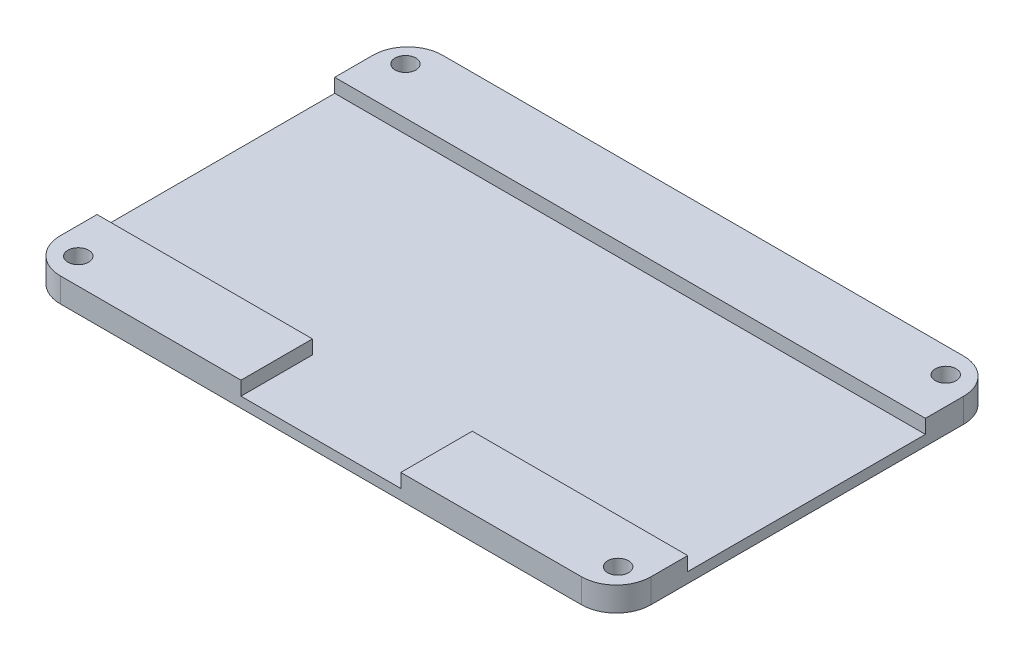
ISO-10303-21;
HEADER;
FILE_DESCRIPTION(('STEP AP214'),'2;1');
FILE_NAME('part.step','',(''),(''),'','','');
FILE_SCHEMA(('AUTOMOTIVE_DESIGN { 1 0 10303 214 1 1 1 1 }'));
ENDSEC;
DATA;
#1=APPLICATION_CONTEXT('core data for automotive mechanical design processes');
#2=APPLICATION_PROTOCOL_DEFINITION('international standard','automotive_design',2000,#1);
#3=PRODUCT_CONTEXT('',#1,'mechanical');
#4=PRODUCT('Part','Part','',(#3));
#5=PRODUCT_RELATED_PRODUCT_CATEGORY('part','',(#4));
#6=PRODUCT_DEFINITION_FORMATION('','',#4);
#7=PRODUCT_DEFINITION_CONTEXT('part definition',#1,'design');
#8=PRODUCT_DEFINITION('design','',#6,#7);
#9=PRODUCT_DEFINITION_SHAPE('','',#8);
#10=(LENGTH_UNIT() NAMED_UNIT(*) SI_UNIT(.MILLI.,.METRE.));
#11=(NAMED_UNIT(*) PLANE_ANGLE_UNIT() SI_UNIT($,.RADIAN.));
#12=(NAMED_UNIT(*) SI_UNIT($,.STERADIAN.) SOLID_ANGLE_UNIT());
#13=UNCERTAINTY_MEASURE_WITH_UNIT(LENGTH_MEASURE(1.E-05),#10,'distance_accuracy_value','');
#14=(GEOMETRIC_REPRESENTATION_CONTEXT(3) GLOBAL_UNCERTAINTY_ASSIGNED_CONTEXT((#13)) GLOBAL_UNIT_ASSIGNED_CONTEXT((#10,
#11,#12)) REPRESENTATION_CONTEXT('',''));
#15=CARTESIAN_POINT('',(0.,0.,0.));
#16=DIRECTION('',(0.,0.,1.));
#17=DIRECTION('',(1.,0.,0.));
#18=AXIS2_PLACEMENT_3D('',#15,#16,#17);
#19=CARTESIAN_POINT('',(59.3775100401606,3.5,-2.56526104417667));
#20=DIRECTION('',(-1.,0.,0.));
#21=DIRECTION('',(0.,0.,1.));
#22=AXIS2_PLACEMENT_3D('',#19,#20,#21);
#23=PLANE('',#22);
#24=DIRECTION('',(0.,1.,0.));
#25=VECTOR('',#24,1.);
#26=CARTESIAN_POINT('',(59.3775100401606,1.5,2.9472813848257));
#27=LINE('',#26,#25);
#28=CARTESIAN_POINT('',(59.3775100401606,1.5,2.9472813848257));
#29=VERTEX_POINT('',#28);
#30=CARTESIAN_POINT('',(59.3775100401606,3.5,2.9472813848257));
#31=VERTEX_POINT('',#30);
#32=EDGE_CURVE('E288',#29,#31,#27,.T.);
#33=ORIENTED_EDGE('',*,*,#32,.F.);
#34=DIRECTION('',(0.,0.,-1.));
#35=VECTOR('',#34,1.);
#36=CARTESIAN_POINT('',(59.3775100401606,1.5,0.));
#37=LINE('',#36,#35);
#38=CARTESIAN_POINT('',(59.3775100401606,1.5,37.1509688802206));
#39=VERTEX_POINT('',#38);
#40=EDGE_CURVE('E335',#39,#29,#37,.T.);
#41=ORIENTED_EDGE('',*,*,#40,.F.);
#42=DIRECTION('',(0.,1.,0.));
#43=VECTOR('',#42,1.);
#44=CARTESIAN_POINT('',(59.3775100401606,1.5,37.1509688802206));
#45=LINE('',#44,#43);
#46=CARTESIAN_POINT('',(59.3775100401606,3.5,37.1509688802206));
#47=VERTEX_POINT('',#46);
#48=EDGE_CURVE('E285',#39,#47,#45,.T.);
#49=ORIENTED_EDGE('',*,*,#48,.T.);
#50=DIRECTION('',(0.,0.,-1.));
#51=VECTOR('',#50,1.);
#52=CARTESIAN_POINT('',(59.3775100401606,3.5,-2.56526104417667));
#53=LINE('',#52,#51);
#54=CARTESIAN_POINT('',(59.3775100401606,3.5,42.4347389558233));
#55=VERTEX_POINT('',#54);
#56=EDGE_CURVE('E109',#55,#47,#53,.T.);
#57=ORIENTED_EDGE('',*,*,#56,.F.);
#58=DIRECTION('',(0.,-1.,0.));
#59=VECTOR('',#58,1.);
#60=CARTESIAN_POINT('',(59.3775100401606,3.5,42.4347389558233));
#61=LINE('',#60,#59);
#62=CARTESIAN_POINT('',(59.3775100401606,0.,42.4347389558233));
#63=VERTEX_POINT('',#62);
#64=EDGE_CURVE('E11',#55,#63,#61,.T.);
#65=ORIENTED_EDGE('',*,*,#64,.T.);
#66=DIRECTION('',(0.,0.,-1.));
#67=VECTOR('',#66,1.);
#68=CARTESIAN_POINT('',(59.3775100401606,0.,-2.56526104417667));
#69=LINE('',#68,#67);
#70=CARTESIAN_POINT('',(59.3775100401606,0.,-2.56526104417667));
#71=VERTEX_POINT('',#70);
#72=EDGE_CURVE('E175',#63,#71,#69,.T.);
#73=ORIENTED_EDGE('',*,*,#72,.T.);
#74=DIRECTION('',(0.,-1.,0.));
#75=VECTOR('',#74,1.);
#76=CARTESIAN_POINT('',(59.3775100401606,3.5,-2.56526104417667));
#77=LINE('',#76,#75);
#78=CARTESIAN_POINT('',(59.3775100401606,3.5,-2.56526104417667));
#79=VERTEX_POINT('',#78);
#80=EDGE_CURVE('E52',#79,#71,#77,.T.);
#81=ORIENTED_EDGE('',*,*,#80,.F.);
#82=EDGE_CURVE('E243',#31,#79,#53,.T.);
#83=ORIENTED_EDGE('',*,*,#82,.F.);
#84=EDGE_LOOP('',(#33,#41,#49,#57,#65,#73,#81,#83));
#85=FACE_BOUND('',#84,.T.);
#86=ADVANCED_FACE('F43',(#85),#23,.F.);
#87=CARTESIAN_POINT('',(54.3775100401606,3.5,42.4347389558233));
#88=DIRECTION('',(0.,1.,0.));
#89=DIRECTION('',(0.,0.,1.));
#90=AXIS2_PLACEMENT_3D('',#87,#88,#89);
#91=PLANE('',#90);
#92=CARTESIAN_POINT('',(-22.1875669871682,3.5,-3.8027186151743));
#93=DIRECTION('',(0.,1.,0.));
#94=DIRECTION('',(0.,0.,1.));
#95=AXIS2_PLACEMENT_3D('',#92,#93,#94);
#96=CIRCLE('',#95,1.5);
#97=CARTESIAN_POINT('',(-22.1875669871682,3.5,-2.3027186151743));
#98=VERTEX_POINT('',#97);
#99=EDGE_CURVE('E258',#98,#98,#96,.T.);
#100=ORIENTED_EDGE('',*,*,#99,.F.);
#101=EDGE_LOOP('',(#100));
#102=FACE_BOUND('',#101,.T.);
#103=CARTESIAN_POINT('',(55.4124330128318,3.5,-3.94786533941863));
#104=DIRECTION('',(0.,1.,0.));
#105=DIRECTION('',(0.,0.,1.));
#106=AXIS2_PLACEMENT_3D('',#103,#104,#105);
#107=CIRCLE('',#106,1.5);
#108=CARTESIAN_POINT('',(55.4124330128318,3.5,-2.44786533941862));
#109=VERTEX_POINT('',#108);
#110=EDGE_CURVE('E267',#109,#109,#107,.T.);
#111=ORIENTED_EDGE('',*,*,#110,.F.);
#112=EDGE_LOOP('',(#111));
#113=FACE_BOUND('',#112,.T.);
#114=DIRECTION('',(0.,0.,1.));
#115=VECTOR('',#114,1.);
#116=CARTESIAN_POINT('',(-25.6224899598394,3.5,-2.56526104417667));
#117=LINE('',#116,#115);
#118=CARTESIAN_POINT('',(-25.6224899598394,3.5,-2.56526104417667));
#119=VERTEX_POINT('',#118);
#120=CARTESIAN_POINT('',(-25.6224899598394,3.5,2.9472813848257));
#121=VERTEX_POINT('',#120);
#122=EDGE_CURVE('E143',#119,#121,#117,.T.);
#123=ORIENTED_EDGE('',*,*,#122,.T.);
#124=DIRECTION('',(1.,0.,0.));
#125=VECTOR('',#124,1.);
#126=CARTESIAN_POINT('',(0.,3.5,2.9472813848257));
#127=LINE('',#126,#125);
#128=EDGE_CURVE('E312',#121,#31,#127,.T.);
#129=ORIENTED_EDGE('',*,*,#128,.T.);
#130=ORIENTED_EDGE('',*,*,#82,.T.);
#131=CARTESIAN_POINT('',(54.3775100401606,3.5,-2.56526104417671));
#132=DIRECTION('',(0.,1.,0.));
#133=DIRECTION('',(0.,0.,1.));
#134=AXIS2_PLACEMENT_3D('',#131,#132,#133);
#135=CIRCLE('',#134,5.);
#136=CARTESIAN_POINT('',(54.3775100401606,3.5,-7.56526104417671));
#137=VERTEX_POINT('',#136);
#138=EDGE_CURVE('E217',#79,#137,#135,.T.);
#139=ORIENTED_EDGE('',*,*,#138,.T.);
#140=DIRECTION('',(-1.,0.,0.));
#141=VECTOR('',#140,1.);
#142=CARTESIAN_POINT('',(-20.6224899598393,3.5,-7.56526104417671));
#143=LINE('',#142,#141);
#144=CARTESIAN_POINT('',(-20.6224899598394,3.5,-7.56526104417671));
#145=VERTEX_POINT('',#144);
#146=EDGE_CURVE('E235',#137,#145,#143,.T.);
#147=ORIENTED_EDGE('',*,*,#146,.T.);
#148=CARTESIAN_POINT('',(-20.6224899598394,3.5,-2.56526104417671));
#149=DIRECTION('',(0.,1.,0.));
#150=DIRECTION('',(0.,0.,-1.));
#151=AXIS2_PLACEMENT_3D('',#148,#149,#150);
#152=CIRCLE('',#151,5.);
#153=EDGE_CURVE('E144',#145,#119,#152,.T.);
#154=ORIENTED_EDGE('',*,*,#153,.T.);
#155=EDGE_LOOP('',(#123,#129,#130,#139,#147,#154));
#156=FACE_BOUND('',#155,.T.);
#157=ADVANCED_FACE('F404',(#102,#113,#156),#91,.T.);
#158=DIRECTION('',(0.,0.,1.));
#159=VECTOR('',#158,1.);
#160=CARTESIAN_POINT('',(5.37751004016062,3.5,0.));
#161=LINE('',#160,#159);
#162=CARTESIAN_POINT('',(5.37751004016063,3.5,37.1509688802206));
#163=VERTEX_POINT('',#162);
#164=CARTESIAN_POINT('',(5.37751004016063,3.5,47.4347389558233));
#165=VERTEX_POINT('',#164);
#166=EDGE_CURVE('E307',#163,#165,#161,.T.);
#167=ORIENTED_EDGE('',*,*,#166,.F.);
#168=DIRECTION('',(1.,0.,0.));
#169=VECTOR('',#168,1.);
#170=CARTESIAN_POINT('',(0.,3.5,37.1509688802206));
#171=LINE('',#170,#169);
#172=CARTESIAN_POINT('',(-25.6224899598394,3.5,37.1509688802206));
#173=VERTEX_POINT('',#172);
#174=EDGE_CURVE('E139',#173,#163,#171,.T.);
#175=ORIENTED_EDGE('',*,*,#174,.F.);
#176=CARTESIAN_POINT('',(-25.6224899598394,3.5,42.4347389558233));
#177=VERTEX_POINT('',#176);
#178=EDGE_CURVE('E128',#173,#177,#117,.T.);
#179=ORIENTED_EDGE('',*,*,#178,.T.);
#180=CARTESIAN_POINT('',(-20.6224899598394,3.5,42.4347389558233));
#181=DIRECTION('',(0.,1.,0.));
#182=DIRECTION('',(0.,0.,-1.));
#183=AXIS2_PLACEMENT_3D('',#180,#181,#182);
#184=CIRCLE('',#183,5.);
#185=CARTESIAN_POINT('',(-20.6224899598393,3.5,47.4347389558233));
#186=VERTEX_POINT('',#185);
#187=EDGE_CURVE('E135',#177,#186,#184,.T.);
#188=ORIENTED_EDGE('',*,*,#187,.T.);
#189=DIRECTION('',(1.,0.,0.));
#190=VECTOR('',#189,1.);
#191=CARTESIAN_POINT('',(-20.6224899598393,3.5,47.4347389558233));
#192=LINE('',#191,#190);
#193=EDGE_CURVE('E164',#186,#165,#192,.T.);
#194=ORIENTED_EDGE('',*,*,#193,.T.);
#195=EDGE_LOOP('',(#167,#175,#179,#188,#194));
#196=FACE_BOUND('',#195,.T.);
#197=CARTESIAN_POINT('',(-21.7754371988893,3.5,43.6972813848257));
#198=DIRECTION('',(0.,1.,0.));
#199=DIRECTION('',(0.,0.,1.));
#200=AXIS2_PLACEMENT_3D('',#197,#198,#199);
#201=CIRCLE('',#200,1.5);
#202=CARTESIAN_POINT('',(-21.7754371988893,3.5,45.1972813848257));
#203=VERTEX_POINT('',#202);
#204=EDGE_CURVE('E246',#203,#203,#201,.T.);
#205=ORIENTED_EDGE('',*,*,#204,.F.);
#206=EDGE_LOOP('',(#205));
#207=FACE_BOUND('',#206,.T.);
#208=ADVANCED_FACE('F131',(#196,#207),#91,.T.);
#209=CARTESIAN_POINT('',(54.3775100401606,3.5,42.4347389558233));
#210=DIRECTION('',(0.,-1.,0.));
#211=DIRECTION('',(0.,0.,-1.));
#212=AXIS2_PLACEMENT_3D('',#209,#210,#211);
#213=CYLINDRICAL_SURFACE('',#212,5.);
#214=CARTESIAN_POINT('',(54.3775100401606,0.,42.4347389558233));
#215=DIRECTION('',(0.,1.,0.));
#216=DIRECTION('',(0.,0.,1.));
#217=AXIS2_PLACEMENT_3D('',#214,#215,#216);
#218=CIRCLE('',#217,5.);
#219=CARTESIAN_POINT('',(54.3775100401606,0.,47.4347389558233));
#220=VERTEX_POINT('',#219);
#221=EDGE_CURVE('E171',#220,#63,#218,.T.);
#222=ORIENTED_EDGE('',*,*,#221,.T.);
#223=ORIENTED_EDGE('',*,*,#64,.F.);
#224=CARTESIAN_POINT('',(54.3775100401606,3.5,42.4347389558233));
#225=DIRECTION('',(0.,1.,0.));
#226=DIRECTION('',(0.,0.,1.));
#227=AXIS2_PLACEMENT_3D('',#224,#225,#226);
#228=CIRCLE('',#227,5.);
#229=CARTESIAN_POINT('',(54.3775100401606,3.5,47.4347389558233));
#230=VERTEX_POINT('',#229);
#231=EDGE_CURVE('E195',#230,#55,#228,.T.);
#232=ORIENTED_EDGE('',*,*,#231,.F.);
#233=DIRECTION('',(0.,-1.,0.));
#234=VECTOR('',#233,1.);
#235=CARTESIAN_POINT('',(54.3775100401606,3.5,47.4347389558233));
#236=LINE('',#235,#234);
#237=EDGE_CURVE('E170',#230,#220,#236,.T.);
#238=ORIENTED_EDGE('',*,*,#237,.T.);
#239=EDGE_LOOP('',(#222,#223,#232,#238));
#240=FACE_BOUND('',#239,.T.);
#241=ADVANCED_FACE('F45',(#240),#213,.T.);
#242=CARTESIAN_POINT('',(54.3775100401606,3.5,-2.56526104417671));
#243=DIRECTION('',(0.,-1.,0.));
#244=DIRECTION('',(0.,0.,-1.));
#245=AXIS2_PLACEMENT_3D('',#242,#243,#244);
#246=CYLINDRICAL_SURFACE('',#245,5.);
#247=CARTESIAN_POINT('',(54.3775100401606,0.,-2.56526104417671));
#248=DIRECTION('',(0.,1.,0.));
#249=DIRECTION('',(0.,0.,1.));
#250=AXIS2_PLACEMENT_3D('',#247,#248,#249);
#251=CIRCLE('',#250,5.);
#252=CARTESIAN_POINT('',(54.3775100401606,0.,-7.56526104417671));
#253=VERTEX_POINT('',#252);
#254=EDGE_CURVE('E179',#71,#253,#251,.T.);
#255=ORIENTED_EDGE('',*,*,#254,.T.);
#256=DIRECTION('',(0.,-1.,0.));
#257=VECTOR('',#256,1.);
#258=CARTESIAN_POINT('',(54.3775100401606,3.5,-7.56526104417671));
#259=LINE('',#258,#257);
#260=EDGE_CURVE('E206',#137,#253,#259,.T.);
#261=ORIENTED_EDGE('',*,*,#260,.F.);
#262=ORIENTED_EDGE('',*,*,#138,.F.);
#263=ORIENTED_EDGE('',*,*,#80,.T.);
#264=EDGE_LOOP('',(#255,#261,#262,#263));
#265=FACE_BOUND('',#264,.T.);
#266=ADVANCED_FACE('F215',(#265),#246,.T.);
#267=CARTESIAN_POINT('',(-20.6224899598393,3.5,-7.56526104417671));
#268=DIRECTION('',(0.,0.,1.));
#269=DIRECTION('',(1.,0.,0.));
#270=AXIS2_PLACEMENT_3D('',#267,#268,#269);
#271=PLANE('',#270);
#272=DIRECTION('',(-1.,0.,0.));
#273=VECTOR('',#272,1.);
#274=CARTESIAN_POINT('',(-20.6224899598393,0.,-7.56526104417671));
#275=LINE('',#274,#273);
#276=CARTESIAN_POINT('',(-20.6224899598394,0.,-7.56526104417671));
#277=VERTEX_POINT('',#276);
#278=EDGE_CURVE('E182',#253,#277,#275,.T.);
#279=ORIENTED_EDGE('',*,*,#278,.T.);
#280=DIRECTION('',(0.,-1.,0.));
#281=VECTOR('',#280,1.);
#282=CARTESIAN_POINT('',(-20.6224899598394,3.5,-7.56526104417671));
#283=LINE('',#282,#281);
#284=EDGE_CURVE('E202',#145,#277,#283,.T.);
#285=ORIENTED_EDGE('',*,*,#284,.F.);
#286=ORIENTED_EDGE('',*,*,#146,.F.);
#287=ORIENTED_EDGE('',*,*,#260,.T.);
#288=EDGE_LOOP('',(#279,#285,#286,#287));
#289=FACE_BOUND('',#288,.T.);
#290=ADVANCED_FACE('F226',(#289),#271,.F.);
#291=CARTESIAN_POINT('',(-20.6224899598394,3.5,-2.56526104417671));
#292=DIRECTION('',(0.,-1.,0.));
#293=DIRECTION('',(0.,0.,-1.));
#294=AXIS2_PLACEMENT_3D('',#291,#292,#293);
#295=CYLINDRICAL_SURFACE('',#294,5.);
#296=CARTESIAN_POINT('',(-20.6224899598394,0.,-2.56526104417671));
#297=DIRECTION('',(0.,1.,0.));
#298=DIRECTION('',(0.,0.,-1.));
#299=AXIS2_PLACEMENT_3D('',#296,#297,#298);
#300=CIRCLE('',#299,5.);
#301=CARTESIAN_POINT('',(-25.6224899598394,0.,-2.56526104417667));
#302=VERTEX_POINT('',#301);
#303=EDGE_CURVE('E185',#277,#302,#300,.T.);
#304=ORIENTED_EDGE('',*,*,#303,.T.);
#305=DIRECTION('',(0.,-1.,0.));
#306=VECTOR('',#305,1.);
#307=CARTESIAN_POINT('',(-25.6224899598394,3.5,-2.56526104417667));
#308=LINE('',#307,#306);
#309=EDGE_CURVE('E155',#119,#302,#308,.T.);
#310=ORIENTED_EDGE('',*,*,#309,.F.);
#311=ORIENTED_EDGE('',*,*,#153,.F.);
#312=ORIENTED_EDGE('',*,*,#284,.T.);
#313=EDGE_LOOP('',(#304,#310,#311,#312));
#314=FACE_BOUND('',#313,.T.);
#315=ADVANCED_FACE('F230',(#314),#295,.T.);
#316=CARTESIAN_POINT('',(-25.6224899598394,3.5,-2.56526104417667));
#317=DIRECTION('',(1.,0.,0.));
#318=DIRECTION('',(0.,0.,-1.));
#319=AXIS2_PLACEMENT_3D('',#316,#317,#318);
#320=PLANE('',#319);
#321=ORIENTED_EDGE('',*,*,#178,.F.);
#322=DIRECTION('',(0.,1.,0.));
#323=VECTOR('',#322,1.);
#324=CARTESIAN_POINT('',(-25.6224899598394,1.5,37.1509688802206));
#325=LINE('',#324,#323);
#326=CARTESIAN_POINT('',(-25.6224899598394,1.5,37.1509688802206));
#327=VERTEX_POINT('',#326);
#328=EDGE_CURVE('E296',#327,#173,#325,.T.);
#329=ORIENTED_EDGE('',*,*,#328,.F.);
#330=DIRECTION('',(0.,0.,1.));
#331=VECTOR('',#330,1.);
#332=CARTESIAN_POINT('',(-25.6224899598394,1.5,0.));
#333=LINE('',#332,#331);
#334=CARTESIAN_POINT('',(-25.6224899598394,1.5,2.9472813848257));
#335=VERTEX_POINT('',#334);
#336=EDGE_CURVE('E327',#335,#327,#333,.T.);
#337=ORIENTED_EDGE('',*,*,#336,.F.);
#338=DIRECTION('',(0.,1.,0.));
#339=VECTOR('',#338,1.);
#340=CARTESIAN_POINT('',(-25.6224899598394,1.5,2.9472813848257));
#341=LINE('',#340,#339);
#342=EDGE_CURVE('E292',#335,#121,#341,.T.);
#343=ORIENTED_EDGE('',*,*,#342,.T.);
#344=ORIENTED_EDGE('',*,*,#122,.F.);
#345=ORIENTED_EDGE('',*,*,#309,.T.);
#346=DIRECTION('',(0.,0.,1.));
#347=VECTOR('',#346,1.);
#348=CARTESIAN_POINT('',(-25.6224899598394,0.,-2.56526104417667));
#349=LINE('',#348,#347);
#350=CARTESIAN_POINT('',(-25.6224899598394,0.,42.4347389558233));
#351=VERTEX_POINT('',#350);
#352=EDGE_CURVE('E151',#302,#351,#349,.T.);
#353=ORIENTED_EDGE('',*,*,#352,.T.);
#354=DIRECTION('',(0.,-1.,0.));
#355=VECTOR('',#354,1.);
#356=CARTESIAN_POINT('',(-25.6224899598394,3.5,42.4347389558233));
#357=LINE('',#356,#355);
#358=EDGE_CURVE('E147',#177,#351,#357,.T.);
#359=ORIENTED_EDGE('',*,*,#358,.F.);
#360=EDGE_LOOP('',(#321,#329,#337,#343,#344,#345,#353,#359));
#361=FACE_BOUND('',#360,.T.);
#362=ADVANCED_FACE('F148',(#361),#320,.F.);
#363=CARTESIAN_POINT('',(-20.6224899598394,3.5,42.4347389558233));
#364=DIRECTION('',(0.,-1.,0.));
#365=DIRECTION('',(0.,0.,-1.));
#366=AXIS2_PLACEMENT_3D('',#363,#364,#365);
#367=CYLINDRICAL_SURFACE('',#366,5.);
#368=CARTESIAN_POINT('',(-20.6224899598394,0.,42.4347389558233));
#369=DIRECTION('',(0.,1.,0.));
#370=DIRECTION('',(0.,0.,-1.));
#371=AXIS2_PLACEMENT_3D('',#368,#369,#370);
#372=CIRCLE('',#371,5.);
#373=CARTESIAN_POINT('',(-20.6224899598393,0.,47.4347389558233));
#374=VERTEX_POINT('',#373);
#375=EDGE_CURVE('E190',#351,#374,#372,.T.);
#376=ORIENTED_EDGE('',*,*,#375,.T.);
#377=DIRECTION('',(0.,-1.,0.));
#378=VECTOR('',#377,1.);
#379=CARTESIAN_POINT('',(-20.6224899598393,3.5,47.4347389558233));
#380=LINE('',#379,#378);
#381=EDGE_CURVE('E156',#186,#374,#380,.T.);
#382=ORIENTED_EDGE('',*,*,#381,.F.);
#383=ORIENTED_EDGE('',*,*,#187,.F.);
#384=ORIENTED_EDGE('',*,*,#358,.T.);
#385=EDGE_LOOP('',(#376,#382,#383,#384));
#386=FACE_BOUND('',#385,.T.);
#387=ADVANCED_FACE('F158',(#386),#367,.T.);
#388=CARTESIAN_POINT('',(-20.6224899598393,3.5,47.4347389558233));
#389=DIRECTION('',(0.,0.,-1.));
#390=DIRECTION('',(-1.,0.,0.));
#391=AXIS2_PLACEMENT_3D('',#388,#389,#390);
#392=PLANE('',#391);
#393=DIRECTION('',(1.,0.,0.));
#394=VECTOR('',#393,1.);
#395=CARTESIAN_POINT('',(0.,1.5,47.4347389558233));
#396=LINE('',#395,#394);
#397=CARTESIAN_POINT('',(5.37751004016063,1.5,47.4347389558233));
#398=VERTEX_POINT('',#397);
#399=CARTESIAN_POINT('',(28.3775100401606,1.5,47.4347389558233));
#400=VERTEX_POINT('',#399);
#401=EDGE_CURVE('E311',#398,#400,#396,.T.);
#402=ORIENTED_EDGE('',*,*,#401,.F.);
#403=DIRECTION('',(0.,1.,0.));
#404=VECTOR('',#403,1.);
#405=CARTESIAN_POINT('',(5.37751004016063,1.5,47.4347389558233));
#406=LINE('',#405,#404);
#407=EDGE_CURVE('E259',#398,#165,#406,.T.);
#408=ORIENTED_EDGE('',*,*,#407,.T.);
#409=ORIENTED_EDGE('',*,*,#193,.F.);
#410=ORIENTED_EDGE('',*,*,#381,.T.);
#411=DIRECTION('',(1.,0.,0.));
#412=VECTOR('',#411,1.);
#413=CARTESIAN_POINT('',(-20.6224899598393,0.,47.4347389558233));
#414=LINE('',#413,#412);
#415=EDGE_CURVE('E101',#374,#220,#414,.T.);
#416=ORIENTED_EDGE('',*,*,#415,.T.);
#417=ORIENTED_EDGE('',*,*,#237,.F.);
#418=CARTESIAN_POINT('',(28.3775100401606,3.5,47.4347389558233));
#419=VERTEX_POINT('',#418);
#420=EDGE_CURVE('E67',#419,#230,#192,.T.);
#421=ORIENTED_EDGE('',*,*,#420,.F.);
#422=DIRECTION('',(0.,1.,0.));
#423=VECTOR('',#422,1.);
#424=CARTESIAN_POINT('',(28.3775100401606,1.5,47.4347389558233));
#425=LINE('',#424,#423);
#426=EDGE_CURVE('E59',#400,#419,#425,.T.);
#427=ORIENTED_EDGE('',*,*,#426,.F.);
#428=EDGE_LOOP('',(#402,#408,#409,#410,#416,#417,#421,#427));
#429=FACE_BOUND('',#428,.T.);
#430=ADVANCED_FACE('F357',(#429),#392,.F.);
#431=CARTESIAN_POINT('',(28.3775100401606,3.5,37.1509688802206));
#432=VERTEX_POINT('',#431);
#433=EDGE_CURVE('E316',#432,#47,#171,.T.);
#434=ORIENTED_EDGE('',*,*,#433,.F.);
#435=DIRECTION('',(0.,0.,-1.));
#436=VECTOR('',#435,1.);
#437=CARTESIAN_POINT('',(28.3775100401606,3.5,0.));
#438=LINE('',#437,#436);
#439=EDGE_CURVE('E320',#419,#432,#438,.T.);
#440=ORIENTED_EDGE('',*,*,#439,.F.);
#441=ORIENTED_EDGE('',*,*,#420,.T.);
#442=ORIENTED_EDGE('',*,*,#231,.T.);
#443=ORIENTED_EDGE('',*,*,#56,.T.);
#444=EDGE_LOOP('',(#434,#440,#441,#442,#443));
#445=FACE_BOUND('',#444,.T.);
#446=CARTESIAN_POINT('',(55.7665058119681,3.5,43.5521346605813));
#447=DIRECTION('',(0.,1.,0.));
#448=DIRECTION('',(0.,0.,1.));
#449=AXIS2_PLACEMENT_3D('',#446,#447,#448);
#450=CIRCLE('',#449,1.5);
#451=CARTESIAN_POINT('',(55.7665058119681,3.5,45.0521346605813));
#452=VERTEX_POINT('',#451);
#453=EDGE_CURVE('E250',#452,#452,#450,.T.);
#454=ORIENTED_EDGE('',*,*,#453,.F.);
#455=EDGE_LOOP('',(#454));
#456=FACE_BOUND('',#455,.T.);
#457=ADVANCED_FACE('F362',(#445,#456),#91,.T.);
#458=CARTESIAN_POINT('',(54.3775100401606,0.,42.4347389558233));
#459=DIRECTION('',(0.,1.,0.));
#460=DIRECTION('',(0.,0.,1.));
#461=AXIS2_PLACEMENT_3D('',#458,#459,#460);
#462=PLANE('',#461);
#463=CARTESIAN_POINT('',(-22.1875669871682,0.,-3.8027186151743));
#464=DIRECTION('',(0.,1.,0.));
#465=DIRECTION('',(0.,0.,1.));
#466=AXIS2_PLACEMENT_3D('',#463,#464,#465);
#467=CIRCLE('',#466,1.5);
#468=CARTESIAN_POINT('',(-22.1875669871682,0.,-2.3027186151743));
#469=VERTEX_POINT('',#468);
#470=EDGE_CURVE('E254',#469,#469,#467,.T.);
#471=ORIENTED_EDGE('',*,*,#470,.T.);
#472=EDGE_LOOP('',(#471));
#473=FACE_BOUND('',#472,.T.);
#474=CARTESIAN_POINT('',(55.4124330128318,0.,-3.94786533941863));
#475=DIRECTION('',(0.,1.,0.));
#476=DIRECTION('',(0.,0.,1.));
#477=AXIS2_PLACEMENT_3D('',#474,#475,#476);
#478=CIRCLE('',#477,1.5);
#479=CARTESIAN_POINT('',(55.4124330128318,0.,-2.44786533941862));
#480=VERTEX_POINT('',#479);
#481=EDGE_CURVE('E263',#480,#480,#478,.T.);
#482=ORIENTED_EDGE('',*,*,#481,.T.);
#483=EDGE_LOOP('',(#482));
#484=FACE_BOUND('',#483,.T.);
#485=CARTESIAN_POINT('',(55.7665058119681,0.,43.5521346605813));
#486=DIRECTION('',(0.,1.,0.));
#487=DIRECTION('',(0.,0.,1.));
#488=AXIS2_PLACEMENT_3D('',#485,#486,#487);
#489=CIRCLE('',#488,1.5);
#490=CARTESIAN_POINT('',(55.7665058119681,0.,45.0521346605813));
#491=VERTEX_POINT('',#490);
#492=EDGE_CURVE('E271',#491,#491,#489,.T.);
#493=ORIENTED_EDGE('',*,*,#492,.T.);
#494=EDGE_LOOP('',(#493));
#495=FACE_BOUND('',#494,.T.);
#496=CARTESIAN_POINT('',(-21.7754371988893,0.,43.6972813848257));
#497=DIRECTION('',(0.,1.,0.));
#498=DIRECTION('',(0.,0.,1.));
#499=AXIS2_PLACEMENT_3D('',#496,#497,#498);
#500=CIRCLE('',#499,1.5);
#501=CARTESIAN_POINT('',(-21.7754371988893,0.,45.1972813848257));
#502=VERTEX_POINT('',#501);
#503=EDGE_CURVE('E176',#502,#502,#500,.T.);
#504=ORIENTED_EDGE('',*,*,#503,.T.);
#505=EDGE_LOOP('',(#504));
#506=FACE_BOUND('',#505,.T.);
#507=ORIENTED_EDGE('',*,*,#221,.F.);
#508=ORIENTED_EDGE('',*,*,#415,.F.);
#509=ORIENTED_EDGE('',*,*,#375,.F.);
#510=ORIENTED_EDGE('',*,*,#352,.F.);
#511=ORIENTED_EDGE('',*,*,#303,.F.);
#512=ORIENTED_EDGE('',*,*,#278,.F.);
#513=ORIENTED_EDGE('',*,*,#254,.F.);
#514=ORIENTED_EDGE('',*,*,#72,.F.);
#515=EDGE_LOOP('',(#507,#508,#509,#510,#511,#512,#513,#514));
#516=FACE_BOUND('',#515,.T.);
#517=ADVANCED_FACE('F222',(#473,#484,#495,#506,#516),#462,.F.);
#518=CARTESIAN_POINT('',(-21.7754371988893,0.,43.6972813848257));
#519=DIRECTION('',(0.,1.,0.));
#520=DIRECTION('',(0.,0.,1.));
#521=AXIS2_PLACEMENT_3D('',#518,#519,#520);
#522=CYLINDRICAL_SURFACE('',#521,1.5);
#523=ORIENTED_EDGE('',*,*,#503,.F.);
#524=EDGE_LOOP('',(#523));
#525=FACE_BOUND('',#524,.T.);
#526=ORIENTED_EDGE('',*,*,#204,.T.);
#527=EDGE_LOOP('',(#526));
#528=FACE_BOUND('',#527,.T.);
#529=ADVANCED_FACE('F441',(#525,#528),#522,.F.);
#530=CARTESIAN_POINT('',(55.7665058119681,0.,43.5521346605813));
#531=DIRECTION('',(0.,1.,0.));
#532=DIRECTION('',(0.,0.,1.));
#533=AXIS2_PLACEMENT_3D('',#530,#531,#532);
#534=CYLINDRICAL_SURFACE('',#533,1.5);
#535=ORIENTED_EDGE('',*,*,#492,.F.);
#536=EDGE_LOOP('',(#535));
#537=FACE_BOUND('',#536,.T.);
#538=ORIENTED_EDGE('',*,*,#453,.T.);
#539=EDGE_LOOP('',(#538));
#540=FACE_BOUND('',#539,.T.);
#541=ADVANCED_FACE('F447',(#537,#540),#534,.F.);
#542=CARTESIAN_POINT('',(55.4124330128318,0.,-3.94786533941863));
#543=DIRECTION('',(0.,1.,0.));
#544=DIRECTION('',(0.,0.,1.));
#545=AXIS2_PLACEMENT_3D('',#542,#543,#544);
#546=CYLINDRICAL_SURFACE('',#545,1.5);
#547=ORIENTED_EDGE('',*,*,#481,.F.);
#548=EDGE_LOOP('',(#547));
#549=FACE_BOUND('',#548,.T.);
#550=ORIENTED_EDGE('',*,*,#110,.T.);
#551=EDGE_LOOP('',(#550));
#552=FACE_BOUND('',#551,.T.);
#553=ADVANCED_FACE('F451',(#549,#552),#546,.F.);
#554=CARTESIAN_POINT('',(-22.1875669871682,0.,-3.8027186151743));
#555=DIRECTION('',(0.,1.,0.));
#556=DIRECTION('',(0.,0.,1.));
#557=AXIS2_PLACEMENT_3D('',#554,#555,#556);
#558=CYLINDRICAL_SURFACE('',#557,1.5);
#559=ORIENTED_EDGE('',*,*,#470,.F.);
#560=EDGE_LOOP('',(#559));
#561=FACE_BOUND('',#560,.T.);
#562=ORIENTED_EDGE('',*,*,#99,.T.);
#563=EDGE_LOOP('',(#562));
#564=FACE_BOUND('',#563,.T.);
#565=ADVANCED_FACE('F418',(#561,#564),#558,.F.);
#566=CARTESIAN_POINT('',(5.37751004016062,1.5,0.));
#567=DIRECTION('',(-1.,0.,0.));
#568=DIRECTION('',(0.,0.,1.));
#569=AXIS2_PLACEMENT_3D('',#566,#567,#568);
#570=PLANE('',#569);
#571=ORIENTED_EDGE('',*,*,#166,.T.);
#572=ORIENTED_EDGE('',*,*,#407,.F.);
#573=DIRECTION('',(0.,0.,1.));
#574=VECTOR('',#573,1.);
#575=CARTESIAN_POINT('',(5.37751004016062,1.5,0.));
#576=LINE('',#575,#574);
#577=CARTESIAN_POINT('',(5.37751004016063,1.5,37.1509688802206));
#578=VERTEX_POINT('',#577);
#579=EDGE_CURVE('E281',#578,#398,#576,.T.);
#580=ORIENTED_EDGE('',*,*,#579,.F.);
#581=DIRECTION('',(0.,1.,0.));
#582=VECTOR('',#581,1.);
#583=CARTESIAN_POINT('',(5.37751004016063,1.5,37.1509688802206));
#584=LINE('',#583,#582);
#585=EDGE_CURVE('E300',#578,#163,#584,.T.);
#586=ORIENTED_EDGE('',*,*,#585,.T.);
#587=EDGE_LOOP('',(#571,#572,#580,#586));
#588=FACE_BOUND('',#587,.T.);
#589=ADVANCED_FACE('F381',(#588),#570,.F.);
#590=CARTESIAN_POINT('',(0.,1.5,37.1509688802206));
#591=DIRECTION('',(0.,0.,1.));
#592=DIRECTION('',(1.,0.,0.));
#593=AXIS2_PLACEMENT_3D('',#590,#591,#592);
#594=PLANE('',#593);
#595=ORIENTED_EDGE('',*,*,#174,.T.);
#596=ORIENTED_EDGE('',*,*,#585,.F.);
#597=DIRECTION('',(1.,0.,0.));
#598=VECTOR('',#597,1.);
#599=CARTESIAN_POINT('',(0.,1.5,37.1509688802206));
#600=LINE('',#599,#598);
#601=EDGE_CURVE('E326',#327,#578,#600,.T.);
#602=ORIENTED_EDGE('',*,*,#601,.F.);
#603=ORIENTED_EDGE('',*,*,#328,.T.);
#604=EDGE_LOOP('',(#595,#596,#602,#603));
#605=FACE_BOUND('',#604,.T.);
#606=ADVANCED_FACE('F407',(#605),#594,.F.);
#607=CARTESIAN_POINT('',(0.,1.5,2.9472813848257));
#608=DIRECTION('',(0.,0.,1.));
#609=DIRECTION('',(1.,0.,0.));
#610=AXIS2_PLACEMENT_3D('',#607,#608,#609);
#611=PLANE('',#610);
#612=ORIENTED_EDGE('',*,*,#128,.F.);
#613=ORIENTED_EDGE('',*,*,#342,.F.);
#614=DIRECTION('',(1.,0.,0.));
#615=VECTOR('',#614,1.);
#616=CARTESIAN_POINT('',(0.,1.5,2.9472813848257));
#617=LINE('',#616,#615);
#618=EDGE_CURVE('E331',#335,#29,#617,.T.);
#619=ORIENTED_EDGE('',*,*,#618,.T.);
#620=ORIENTED_EDGE('',*,*,#32,.T.);
#621=EDGE_LOOP('',(#612,#613,#619,#620));
#622=FACE_BOUND('',#621,.T.);
#623=ADVANCED_FACE('F403',(#622),#611,.T.);
#624=ORIENTED_EDGE('',*,*,#433,.T.);
#625=ORIENTED_EDGE('',*,*,#48,.F.);
#626=CARTESIAN_POINT('',(28.3775100401606,1.5,37.1509688802206));
#627=VERTEX_POINT('',#626);
#628=EDGE_CURVE('E339',#627,#39,#600,.T.);
#629=ORIENTED_EDGE('',*,*,#628,.F.);
#630=DIRECTION('',(0.,1.,0.));
#631=VECTOR('',#630,1.);
#632=CARTESIAN_POINT('',(28.3775100401606,1.5,37.1509688802206));
#633=LINE('',#632,#631);
#634=EDGE_CURVE('E280',#627,#432,#633,.T.);
#635=ORIENTED_EDGE('',*,*,#634,.T.);
#636=EDGE_LOOP('',(#624,#625,#629,#635));
#637=FACE_BOUND('',#636,.T.);
#638=ADVANCED_FACE('F398',(#637),#594,.F.);
#639=CARTESIAN_POINT('',(28.3775100401606,1.5,0.));
#640=DIRECTION('',(1.,0.,0.));
#641=DIRECTION('',(0.,0.,-1.));
#642=AXIS2_PLACEMENT_3D('',#639,#640,#641);
#643=PLANE('',#642);
#644=ORIENTED_EDGE('',*,*,#439,.T.);
#645=ORIENTED_EDGE('',*,*,#634,.F.);
#646=DIRECTION('',(0.,0.,-1.));
#647=VECTOR('',#646,1.);
#648=CARTESIAN_POINT('',(28.3775100401606,1.5,0.));
#649=LINE('',#648,#647);
#650=EDGE_CURVE('E343',#400,#627,#649,.T.);
#651=ORIENTED_EDGE('',*,*,#650,.F.);
#652=ORIENTED_EDGE('',*,*,#426,.T.);
#653=EDGE_LOOP('',(#644,#645,#651,#652));
#654=FACE_BOUND('',#653,.T.);
#655=ADVANCED_FACE('F397',(#654),#643,.F.);
#656=CARTESIAN_POINT('',(0.,1.5,0.));
#657=DIRECTION('',(0.,1.,0.));
#658=DIRECTION('',(0.,0.,1.));
#659=AXIS2_PLACEMENT_3D('',#656,#657,#658);
#660=PLANE('',#659);
#661=ORIENTED_EDGE('',*,*,#401,.T.);
#662=ORIENTED_EDGE('',*,*,#650,.T.);
#663=ORIENTED_EDGE('',*,*,#628,.T.);
#664=ORIENTED_EDGE('',*,*,#40,.T.);
#665=ORIENTED_EDGE('',*,*,#618,.F.);
#666=ORIENTED_EDGE('',*,*,#336,.T.);
#667=ORIENTED_EDGE('',*,*,#601,.T.);
#668=ORIENTED_EDGE('',*,*,#579,.T.);
#669=EDGE_LOOP('',(#661,#662,#663,#664,#665,#666,#667,#668));
#670=FACE_BOUND('',#669,.T.);
#671=ADVANCED_FACE('F352',(#670),#660,.T.);
#672=CLOSED_SHELL('',(#86,#157,#208,#241,#266,#290,#315,#362,#387,#430,#457,#517,#529,#541,#553,
#565,#589,#606,#623,#638,#655,#671));
#673=MANIFOLD_SOLID_BREP('B2',#672);
#674=ADVANCED_BREP_SHAPE_REPRESENTATION('',(#18,#673),#14);
#675=SHAPE_DEFINITION_REPRESENTATION(#9,#674);
ENDSEC;
END-ISO-10303-21;
